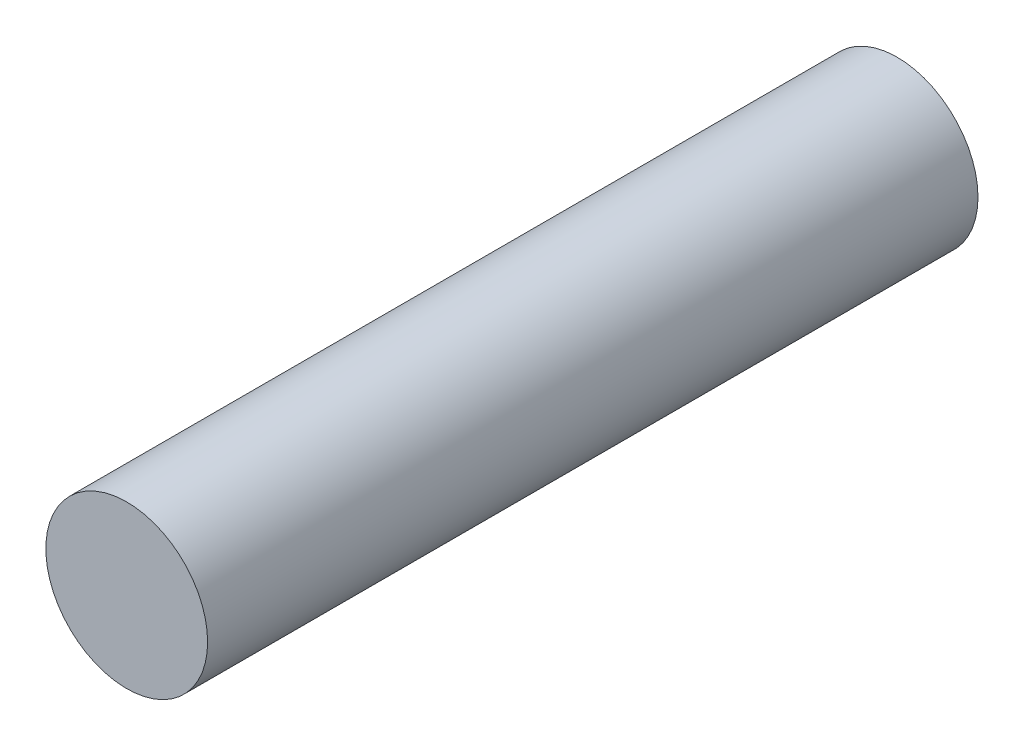
ISO-10303-21;
HEADER;
FILE_DESCRIPTION(('STEP AP214'),'2;1');
FILE_NAME('part.step','',(''),(''),'','','');
FILE_SCHEMA(('AUTOMOTIVE_DESIGN { 1 0 10303 214 1 1 1 1 }'));
ENDSEC;
DATA;
#1=APPLICATION_CONTEXT('core data for automotive mechanical design processes');
#2=APPLICATION_PROTOCOL_DEFINITION('international standard','automotive_design',2000,#1);
#3=PRODUCT_CONTEXT('',#1,'mechanical');
#4=PRODUCT('Part','Part','',(#3));
#5=PRODUCT_RELATED_PRODUCT_CATEGORY('part','',(#4));
#6=PRODUCT_DEFINITION_FORMATION('','',#4);
#7=PRODUCT_DEFINITION_CONTEXT('part definition',#1,'design');
#8=PRODUCT_DEFINITION('design','',#6,#7);
#9=PRODUCT_DEFINITION_SHAPE('','',#8);
#10=(LENGTH_UNIT() NAMED_UNIT(*) SI_UNIT(.MILLI.,.METRE.));
#11=(NAMED_UNIT(*) PLANE_ANGLE_UNIT() SI_UNIT($,.RADIAN.));
#12=(NAMED_UNIT(*) SI_UNIT($,.STERADIAN.) SOLID_ANGLE_UNIT());
#13=UNCERTAINTY_MEASURE_WITH_UNIT(LENGTH_MEASURE(1.E-05),#10,'distance_accuracy_value','');
#14=(GEOMETRIC_REPRESENTATION_CONTEXT(3) GLOBAL_UNCERTAINTY_ASSIGNED_CONTEXT((#13)) GLOBAL_UNIT_ASSIGNED_CONTEXT((#10,
#11,#12)) REPRESENTATION_CONTEXT('',''));
#15=CARTESIAN_POINT('',(0.,0.,0.));
#16=DIRECTION('',(0.,0.,1.));
#17=DIRECTION('',(1.,0.,0.));
#18=AXIS2_PLACEMENT_3D('',#15,#16,#17);
#19=CARTESIAN_POINT('',(0.,0.,10.));
#20=DIRECTION('',(0.,0.,-1.));
#21=DIRECTION('',(-1.,0.,0.));
#22=AXIS2_PLACEMENT_3D('',#19,#20,#21);
#23=CYLINDRICAL_SURFACE('',#22,1.05);
#24=CARTESIAN_POINT('',(0.,0.,10.));
#25=DIRECTION('',(0.,0.,1.));
#26=DIRECTION('',(1.,0.,0.));
#27=AXIS2_PLACEMENT_3D('',#24,#25,#26);
#28=CIRCLE('',#27,1.05);
#29=CARTESIAN_POINT('',(1.05,0.,10.));
#30=VERTEX_POINT('',#29);
#31=EDGE_CURVE('E10',#30,#30,#28,.T.);
#32=ORIENTED_EDGE('',*,*,#31,.F.);
#33=EDGE_LOOP('',(#32));
#34=FACE_BOUND('',#33,.T.);
#35=CARTESIAN_POINT('',(0.,0.,0.));
#36=DIRECTION('',(0.,0.,1.));
#37=DIRECTION('',(1.,0.,0.));
#38=AXIS2_PLACEMENT_3D('',#35,#36,#37);
#39=CIRCLE('',#38,1.05);
#40=CARTESIAN_POINT('',(1.05,0.,0.));
#41=VERTEX_POINT('',#40);
#42=EDGE_CURVE('E34',#41,#41,#39,.T.);
#43=ORIENTED_EDGE('',*,*,#42,.T.);
#44=EDGE_LOOP('',(#43));
#45=FACE_BOUND('',#44,.T.);
#46=ADVANCED_FACE('F31',(#34,#45),#23,.T.);
#47=CARTESIAN_POINT('',(0.,0.,10.));
#48=DIRECTION('',(0.,0.,1.));
#49=DIRECTION('',(1.,0.,0.));
#50=AXIS2_PLACEMENT_3D('',#47,#48,#49);
#51=PLANE('',#50);
#52=ORIENTED_EDGE('',*,*,#31,.T.);
#53=EDGE_LOOP('',(#52));
#54=FACE_BOUND('',#53,.T.);
#55=ADVANCED_FACE('F46',(#54),#51,.T.);
#56=CARTESIAN_POINT('',(0.,0.,0.));
#57=DIRECTION('',(0.,0.,1.));
#58=DIRECTION('',(1.,0.,0.));
#59=AXIS2_PLACEMENT_3D('',#56,#57,#58);
#60=PLANE('',#59);
#61=ORIENTED_EDGE('',*,*,#42,.F.);
#62=EDGE_LOOP('',(#61));
#63=FACE_BOUND('',#62,.T.);
#64=ADVANCED_FACE('F44',(#63),#60,.F.);
#65=CLOSED_SHELL('',(#46,#55,#64));
#66=MANIFOLD_SOLID_BREP('B2',#65);
#67=ADVANCED_BREP_SHAPE_REPRESENTATION('',(#18,#66),#14);
#68=SHAPE_DEFINITION_REPRESENTATION(#9,#67);
ENDSEC;
END-ISO-10303-21;
